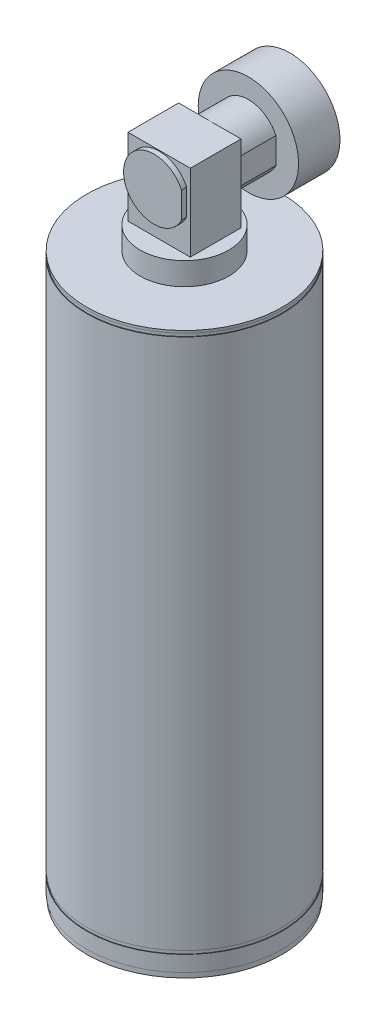
ISO-10303-21;
HEADER;
FILE_DESCRIPTION(('STEP AP214'),'2;1');
FILE_NAME('part.step','',(''),(''),'','','');
FILE_SCHEMA(('AUTOMOTIVE_DESIGN { 1 0 10303 214 1 1 1 1 }'));
ENDSEC;
DATA;
#1=APPLICATION_CONTEXT('core data for automotive mechanical design processes');
#2=APPLICATION_PROTOCOL_DEFINITION('international standard','automotive_design',2000,#1);
#3=PRODUCT_CONTEXT('',#1,'mechanical');
#4=PRODUCT('Part','Part','',(#3));
#5=PRODUCT_RELATED_PRODUCT_CATEGORY('part','',(#4));
#6=PRODUCT_DEFINITION_FORMATION('','',#4);
#7=PRODUCT_DEFINITION_CONTEXT('part definition',#1,'design');
#8=PRODUCT_DEFINITION('design','',#6,#7);
#9=PRODUCT_DEFINITION_SHAPE('','',#8);
#10=(LENGTH_UNIT() NAMED_UNIT(*) SI_UNIT(.MILLI.,.METRE.));
#11=(NAMED_UNIT(*) PLANE_ANGLE_UNIT() SI_UNIT($,.RADIAN.));
#12=(NAMED_UNIT(*) SI_UNIT($,.STERADIAN.) SOLID_ANGLE_UNIT());
#13=UNCERTAINTY_MEASURE_WITH_UNIT(LENGTH_MEASURE(1.E-05),#10,'distance_accuracy_value','');
#14=(GEOMETRIC_REPRESENTATION_CONTEXT(3) GLOBAL_UNCERTAINTY_ASSIGNED_CONTEXT((#13)) GLOBAL_UNIT_ASSIGNED_CONTEXT((#10,
#11,#12)) REPRESENTATION_CONTEXT('',''));
#15=CARTESIAN_POINT('',(0.,0.,0.));
#16=DIRECTION('',(0.,0.,1.));
#17=DIRECTION('',(1.,0.,0.));
#18=AXIS2_PLACEMENT_3D('',#15,#16,#17);
#19=CARTESIAN_POINT('',(-43.0000000000064,912.000000000001,35.0000000484059));
#20=DIRECTION('',(0.,0.,-1.));
#21=DIRECTION('',(-1.,0.,0.));
#22=AXIS2_PLACEMENT_3D('',#19,#20,#21);
#23=PLANE('',#22);
#24=DIRECTION('',(1.,0.,0.));
#25=VECTOR('',#24,1.);
#26=CARTESIAN_POINT('',(-43.0000000000064,805.70816,35.0000000484059));
#27=LINE('',#26,#25);
#28=CARTESIAN_POINT('',(-43.0000000000064,805.70816,35.0000000484059));
#29=VERTEX_POINT('',#28);
#30=CARTESIAN_POINT('',(42.9999999999779,805.70816,35.0000000484059));
#31=VERTEX_POINT('',#30);
#32=EDGE_CURVE('E142',#29,#31,#27,.T.);
#33=ORIENTED_EDGE('',*,*,#32,.T.);
#34=DIRECTION('',(0.,-1.,0.));
#35=VECTOR('',#34,1.);
#36=CARTESIAN_POINT('',(42.9999999999779,912.000000000001,35.0000000484059));
#37=LINE('',#36,#35);
#38=CARTESIAN_POINT('',(42.9999999999779,912.000000000001,35.0000000484059));
#39=VERTEX_POINT('',#38);
#40=EDGE_CURVE('E152',#39,#31,#37,.T.);
#41=ORIENTED_EDGE('',*,*,#40,.F.);
#42=DIRECTION('',(1.,0.,0.));
#43=VECTOR('',#42,1.);
#44=CARTESIAN_POINT('',(-43.0000000000064,912.000000000001,35.0000000484059));
#45=LINE('',#44,#43);
#46=CARTESIAN_POINT('',(-43.0000000000064,912.000000000001,35.0000000484059));
#47=VERTEX_POINT('',#46);
#48=EDGE_CURVE('E132',#47,#39,#45,.T.);
#49=ORIENTED_EDGE('',*,*,#48,.F.);
#50=DIRECTION('',(0.,-1.,0.));
#51=VECTOR('',#50,1.);
#52=CARTESIAN_POINT('',(-43.0000000000064,912.000000000001,35.0000000484059));
#53=LINE('',#52,#51);
#54=EDGE_CURVE('E155',#47,#29,#53,.T.);
#55=ORIENTED_EDGE('',*,*,#54,.T.);
#56=EDGE_LOOP('',(#33,#41,#49,#55));
#57=FACE_BOUND('',#56,.T.);
#58=CARTESIAN_POINT('',(0.,869.000000000002,35.0000000484059));
#59=DIRECTION('',(0.,0.,-1.));
#60=DIRECTION('',(-1.,0.,0.));
#61=AXIS2_PLACEMENT_3D('',#58,#59,#60);
#62=CIRCLE('',#61,41.999998400008);
#63=CARTESIAN_POINT('',(37.9999964871783,886.888547525587,35.0000000484059));
#64=VERTEX_POINT('',#63);
#65=CARTESIAN_POINT('',(37.9999964871783,851.111452474417,35.0000000484059));
#66=VERTEX_POINT('',#65);
#67=EDGE_CURVE('E126',#64,#66,#62,.F.);
#68=ORIENTED_EDGE('',*,*,#67,.F.);
#69=DIRECTION('',(0.,1.,0.));
#70=VECTOR('',#69,1.);
#71=CARTESIAN_POINT('',(37.9999964871783,912.000000000001,35.0000000484059));
#72=LINE('',#71,#70);
#73=EDGE_CURVE('E47',#66,#64,#72,.T.);
#74=ORIENTED_EDGE('',*,*,#73,.F.);
#75=EDGE_LOOP('',(#68,#74));
#76=FACE_BOUND('',#75,.T.);
#77=ADVANCED_FACE('F33',(#57,#76),#23,.F.);
#78=CARTESIAN_POINT('',(-43.0000000000064,912.000000000001,-34.9999999515944));
#79=DIRECTION('',(0.,0.,1.));
#80=DIRECTION('',(1.,0.,0.));
#81=AXIS2_PLACEMENT_3D('',#78,#79,#80);
#82=PLANE('',#81);
#83=DIRECTION('',(-1.,0.,0.));
#84=VECTOR('',#83,1.);
#85=CARTESIAN_POINT('',(-43.0000000000064,805.70816,-34.9999999515944));
#86=LINE('',#85,#84);
#87=CARTESIAN_POINT('',(42.9999999999779,805.70816,-34.9999999515944));
#88=VERTEX_POINT('',#87);
#89=CARTESIAN_POINT('',(-43.0000000000064,805.70816,-34.9999999515944));
#90=VERTEX_POINT('',#89);
#91=EDGE_CURVE('E133',#88,#90,#86,.T.);
#92=ORIENTED_EDGE('',*,*,#91,.T.);
#93=DIRECTION('',(0.,-1.,0.));
#94=VECTOR('',#93,1.);
#95=CARTESIAN_POINT('',(-43.0000000000064,912.000000000001,-34.9999999515944));
#96=LINE('',#95,#94);
#97=CARTESIAN_POINT('',(-43.0000000000064,912.000000000001,-34.9999999515944));
#98=VERTEX_POINT('',#97);
#99=EDGE_CURVE('E139',#98,#90,#96,.T.);
#100=ORIENTED_EDGE('',*,*,#99,.F.);
#101=DIRECTION('',(-1.,0.,0.));
#102=VECTOR('',#101,1.);
#103=CARTESIAN_POINT('',(-43.0000000000064,912.000000000001,-34.9999999515944));
#104=LINE('',#103,#102);
#105=CARTESIAN_POINT('',(42.9999999999779,912.000000000001,-34.9999999515944));
#106=VERTEX_POINT('',#105);
#107=EDGE_CURVE('E137',#106,#98,#104,.T.);
#108=ORIENTED_EDGE('',*,*,#107,.F.);
#109=DIRECTION('',(0.,-1.,0.));
#110=VECTOR('',#109,1.);
#111=CARTESIAN_POINT('',(42.9999999999779,912.000000000001,-34.9999999515944));
#112=LINE('',#111,#110);
#113=EDGE_CURVE('E150',#106,#88,#112,.T.);
#114=ORIENTED_EDGE('',*,*,#113,.T.);
#115=EDGE_LOOP('',(#92,#100,#108,#114));
#116=FACE_BOUND('',#115,.T.);
#117=CARTESIAN_POINT('',(0.,869.000000000002,-34.9999999515944));
#118=DIRECTION('',(0.,0.,1.));
#119=DIRECTION('',(1.,0.,0.));
#120=AXIS2_PLACEMENT_3D('',#117,#118,#119);
#121=CIRCLE('',#120,41.999998400008);
#122=CARTESIAN_POINT('',(37.9999964871783,851.111452474417,-34.9999999515944));
#123=VERTEX_POINT('',#122);
#124=CARTESIAN_POINT('',(37.9999964871783,886.888547525587,-34.9999999515944));
#125=VERTEX_POINT('',#124);
#126=EDGE_CURVE('E11',#123,#125,#121,.F.);
#127=ORIENTED_EDGE('',*,*,#126,.F.);
#128=DIRECTION('',(0.,-1.,0.));
#129=VECTOR('',#128,1.);
#130=CARTESIAN_POINT('',(37.9999964871783,912.000000000001,-34.9999999515944));
#131=LINE('',#130,#129);
#132=EDGE_CURVE('E41',#125,#123,#131,.T.);
#133=ORIENTED_EDGE('',*,*,#132,.F.);
#134=EDGE_LOOP('',(#127,#133));
#135=FACE_BOUND('',#134,.T.);
#136=ADVANCED_FACE('F217',(#116,#135),#82,.F.);
#137=CARTESIAN_POINT('',(0.,805.70816,0.));
#138=DIRECTION('',(0.,1.,0.));
#139=DIRECTION('',(0.,0.,1.));
#140=AXIS2_PLACEMENT_3D('',#137,#138,#139);
#141=PLANE('',#140);
#142=CARTESIAN_POINT('',(0.,805.70816,0.));
#143=DIRECTION('',(0.,1.,0.));
#144=DIRECTION('',(0.,0.,1.));
#145=AXIS2_PLACEMENT_3D('',#142,#143,#144);
#146=CIRCLE('',#145,61.1435466232673);
#147=CARTESIAN_POINT('',(0.,805.70816,61.1435466232673));
#148=VERTEX_POINT('',#147);
#149=EDGE_CURVE('E158',#148,#148,#146,.T.);
#150=ORIENTED_EDGE('',*,*,#149,.T.);
#151=EDGE_LOOP('',(#150));
#152=FACE_BOUND('',#151,.T.);
#153=ORIENTED_EDGE('',*,*,#32,.F.);
#154=DIRECTION('',(0.,0.,1.));
#155=VECTOR('',#154,1.);
#156=CARTESIAN_POINT('',(-43.0000000000064,805.70816,-34.9999999515944));
#157=LINE('',#156,#155);
#158=EDGE_CURVE('E128',#90,#29,#157,.T.);
#159=ORIENTED_EDGE('',*,*,#158,.F.);
#160=ORIENTED_EDGE('',*,*,#91,.F.);
#161=DIRECTION('',(0.,0.,-1.));
#162=VECTOR('',#161,1.);
#163=CARTESIAN_POINT('',(42.9999999999779,805.70816,-34.9999999515944));
#164=LINE('',#163,#162);
#165=EDGE_CURVE('E144',#31,#88,#164,.T.);
#166=ORIENTED_EDGE('',*,*,#165,.F.);
#167=EDGE_LOOP('',(#153,#159,#160,#166));
#168=FACE_BOUND('',#167,.T.);
#169=ADVANCED_FACE('F223',(#152,#168),#141,.T.);
#170=CARTESIAN_POINT('',(0.,774.49918,0.));
#171=DIRECTION('',(0.,1.,0.));
#172=DIRECTION('',(0.,0.,1.));
#173=AXIS2_PLACEMENT_3D('',#170,#171,#172);
#174=PLANE('',#173);
#175=CARTESIAN_POINT('',(0.,774.49918,0.));
#176=DIRECTION('',(0.,1.,0.));
#177=DIRECTION('',(0.,0.,1.));
#178=AXIS2_PLACEMENT_3D('',#175,#176,#177);
#179=CIRCLE('',#178,135.080809957641);
#180=CARTESIAN_POINT('',(0.,774.49918,135.080809957641));
#181=VERTEX_POINT('',#180);
#182=EDGE_CURVE('E164',#181,#181,#179,.T.);
#183=ORIENTED_EDGE('',*,*,#182,.T.);
#184=EDGE_LOOP('',(#183));
#185=FACE_BOUND('',#184,.T.);
#186=CARTESIAN_POINT('',(0.,774.49918,0.));
#187=DIRECTION('',(0.,1.,0.));
#188=DIRECTION('',(0.,0.,1.));
#189=AXIS2_PLACEMENT_3D('',#186,#187,#188);
#190=CIRCLE('',#189,61.1435466232673);
#191=CARTESIAN_POINT('',(0.,774.49918,61.1435466232673));
#192=VERTEX_POINT('',#191);
#193=EDGE_CURVE('E157',#192,#192,#190,.T.);
#194=ORIENTED_EDGE('',*,*,#193,.F.);
#195=EDGE_LOOP('',(#194));
#196=FACE_BOUND('',#195,.T.);
#197=ADVANCED_FACE('F236',(#185,#196),#174,.T.);
#198=CARTESIAN_POINT('',(0.,766.7852,0.));
#199=DIRECTION('',(0.,1.,0.));
#200=DIRECTION('',(0.,0.,1.));
#201=AXIS2_PLACEMENT_3D('',#198,#199,#200);
#202=PLANE('',#201);
#203=CARTESIAN_POINT('',(0.,766.7852,0.));
#204=DIRECTION('',(0.,1.,0.));
#205=DIRECTION('',(0.,0.,1.));
#206=AXIS2_PLACEMENT_3D('',#203,#204,#205);
#207=CIRCLE('',#206,135.080809957641);
#208=CARTESIAN_POINT('',(0.,766.7852,135.080809957641));
#209=VERTEX_POINT('',#208);
#210=EDGE_CURVE('E176',#209,#209,#207,.T.);
#211=ORIENTED_EDGE('',*,*,#210,.T.);
#212=EDGE_LOOP('',(#211));
#213=FACE_BOUND('',#212,.T.);
#214=CARTESIAN_POINT('',(0.,766.7852,0.));
#215=DIRECTION('',(0.,1.,0.));
#216=DIRECTION('',(0.,0.,1.));
#217=AXIS2_PLACEMENT_3D('',#214,#215,#216);
#218=CIRCLE('',#217,134.318809957641);
#219=CARTESIAN_POINT('',(0.,766.7852,134.318809957641));
#220=VERTEX_POINT('',#219);
#221=EDGE_CURVE('E167',#220,#220,#218,.T.);
#222=ORIENTED_EDGE('',*,*,#221,.F.);
#223=EDGE_LOOP('',(#222));
#224=FACE_BOUND('',#223,.T.);
#225=ADVANCED_FACE('F244',(#213,#224),#202,.T.);
#226=CARTESIAN_POINT('',(0.,28.6905999999991,0.));
#227=DIRECTION('',(0.,1.,0.));
#228=DIRECTION('',(0.,0.,1.));
#229=AXIS2_PLACEMENT_3D('',#226,#227,#228);
#230=PLANE('',#229);
#231=CARTESIAN_POINT('',(0.,28.6905999999991,0.));
#232=DIRECTION('',(0.,1.,0.));
#233=DIRECTION('',(0.,0.,1.));
#234=AXIS2_PLACEMENT_3D('',#231,#232,#233);
#235=CIRCLE('',#234,135.080809957641);
#236=CARTESIAN_POINT('',(0.,28.6905999999991,135.080809957641));
#237=VERTEX_POINT('',#236);
#238=EDGE_CURVE('E188',#237,#237,#235,.T.);
#239=ORIENTED_EDGE('',*,*,#238,.T.);
#240=EDGE_LOOP('',(#239));
#241=FACE_BOUND('',#240,.T.);
#242=CARTESIAN_POINT('',(0.,28.6905999999991,0.));
#243=DIRECTION('',(0.,1.,0.));
#244=DIRECTION('',(0.,0.,1.));
#245=AXIS2_PLACEMENT_3D('',#242,#243,#244);
#246=CIRCLE('',#245,134.318809957641);
#247=CARTESIAN_POINT('',(0.,28.6905999999991,134.318809957641));
#248=VERTEX_POINT('',#247);
#249=EDGE_CURVE('E179',#248,#248,#246,.T.);
#250=ORIENTED_EDGE('',*,*,#249,.F.);
#251=EDGE_LOOP('',(#250));
#252=FACE_BOUND('',#251,.T.);
#253=ADVANCED_FACE('F212',(#241,#252),#230,.T.);
#254=CARTESIAN_POINT('',(0.,7.0358,0.));
#255=DIRECTION('',(0.,-1.,0.));
#256=DIRECTION('',(0.,0.,-1.));
#257=AXIS2_PLACEMENT_3D('',#254,#255,#256);
#258=CYLINDRICAL_SURFACE('',#257,134.318809957641);
#259=CARTESIAN_POINT('',(0.,7.0358,0.));
#260=DIRECTION('',(0.,1.,0.));
#261=DIRECTION('',(0.,0.,1.));
#262=AXIS2_PLACEMENT_3D('',#259,#260,#261);
#263=CIRCLE('',#262,134.318809957641);
#264=CARTESIAN_POINT('',(0.,7.0358,134.318809957641));
#265=VERTEX_POINT('',#264);
#266=EDGE_CURVE('E194',#265,#265,#263,.T.);
#267=ORIENTED_EDGE('',*,*,#266,.F.);
#268=EDGE_LOOP('',(#267));
#269=FACE_BOUND('',#268,.T.);
#270=CARTESIAN_POINT('',(0.,0.,0.));
#271=DIRECTION('',(0.,1.,0.));
#272=DIRECTION('',(0.,0.,1.));
#273=AXIS2_PLACEMENT_3D('',#270,#271,#272);
#274=CIRCLE('',#273,134.318809957641);
#275=CARTESIAN_POINT('',(0.,0.,134.318809957641));
#276=VERTEX_POINT('',#275);
#277=EDGE_CURVE('E191',#276,#276,#274,.T.);
#278=ORIENTED_EDGE('',*,*,#277,.T.);
#279=EDGE_LOOP('',(#278));
#280=FACE_BOUND('',#279,.T.);
#281=ADVANCED_FACE('F35',(#269,#280),#258,.T.);
#282=CARTESIAN_POINT('',(0.,0.,0.));
#283=DIRECTION('',(0.,1.,0.));
#284=DIRECTION('',(0.,0.,1.));
#285=AXIS2_PLACEMENT_3D('',#282,#283,#284);
#286=PLANE('',#285);
#287=CARTESIAN_POINT('',(0.,0.,0.));
#288=DIRECTION('',(0.,-1.,0.));
#289=DIRECTION('',(0.,0.,-1.));
#290=AXIS2_PLACEMENT_3D('',#287,#288,#289);
#291=CIRCLE('',#290,31.1916417026283);
#292=CARTESIAN_POINT('',(0.,0.,-31.1916417026283));
#293=VERTEX_POINT('',#292);
#294=EDGE_CURVE('E503',#293,#293,#291,.T.);
#295=ORIENTED_EDGE('',*,*,#294,.F.);
#296=EDGE_LOOP('',(#295));
#297=FACE_BOUND('',#296,.T.);
#298=ORIENTED_EDGE('',*,*,#277,.F.);
#299=EDGE_LOOP('',(#298));
#300=FACE_BOUND('',#299,.T.);
#301=ADVANCED_FACE('F201',(#297,#300),#286,.F.);
#302=CARTESIAN_POINT('',(0.,7.0358,0.));
#303=DIRECTION('',(0.,1.,0.));
#304=DIRECTION('',(0.,0.,1.));
#305=AXIS2_PLACEMENT_3D('',#302,#303,#304);
#306=PLANE('',#305);
#307=CARTESIAN_POINT('',(0.,7.0358,0.));
#308=DIRECTION('',(0.,1.,0.));
#309=DIRECTION('',(0.,0.,1.));
#310=AXIS2_PLACEMENT_3D('',#307,#308,#309);
#311=CIRCLE('',#310,135.080809957641);
#312=CARTESIAN_POINT('',(0.,7.0358,135.080809957641));
#313=VERTEX_POINT('',#312);
#314=EDGE_CURVE('E185',#313,#313,#311,.T.);
#315=ORIENTED_EDGE('',*,*,#314,.F.);
#316=EDGE_LOOP('',(#315));
#317=FACE_BOUND('',#316,.T.);
#318=ORIENTED_EDGE('',*,*,#266,.T.);
#319=EDGE_LOOP('',(#318));
#320=FACE_BOUND('',#319,.T.);
#321=ADVANCED_FACE('F203',(#317,#320),#306,.F.);
#322=CARTESIAN_POINT('',(0.,28.6905999999991,0.));
#323=DIRECTION('',(0.,-1.,0.));
#324=DIRECTION('',(0.,0.,-1.));
#325=AXIS2_PLACEMENT_3D('',#322,#323,#324);
#326=CYLINDRICAL_SURFACE('',#325,135.080809957641);
#327=ORIENTED_EDGE('',*,*,#238,.F.);
#328=EDGE_LOOP('',(#327));
#329=FACE_BOUND('',#328,.T.);
#330=ORIENTED_EDGE('',*,*,#314,.T.);
#331=EDGE_LOOP('',(#330));
#332=FACE_BOUND('',#331,.T.);
#333=ADVANCED_FACE('F209',(#329,#332),#326,.T.);
#334=CARTESIAN_POINT('',(0.,33.3094000000003,0.));
#335=DIRECTION('',(0.,-1.,0.));
#336=DIRECTION('',(0.,0.,-1.));
#337=AXIS2_PLACEMENT_3D('',#334,#335,#336);
#338=CYLINDRICAL_SURFACE('',#337,134.318809957641);
#339=CARTESIAN_POINT('',(0.,33.3094000000003,0.));
#340=DIRECTION('',(0.,1.,0.));
#341=DIRECTION('',(0.,0.,1.));
#342=AXIS2_PLACEMENT_3D('',#339,#340,#341);
#343=CIRCLE('',#342,134.318809957641);
#344=CARTESIAN_POINT('',(0.,33.3094000000003,134.318809957641));
#345=VERTEX_POINT('',#344);
#346=EDGE_CURVE('E182',#345,#345,#343,.T.);
#347=ORIENTED_EDGE('',*,*,#346,.F.);
#348=EDGE_LOOP('',(#347));
#349=FACE_BOUND('',#348,.T.);
#350=ORIENTED_EDGE('',*,*,#249,.T.);
#351=EDGE_LOOP('',(#350));
#352=FACE_BOUND('',#351,.T.);
#353=ADVANCED_FACE('F264',(#349,#352),#338,.T.);
#354=CARTESIAN_POINT('',(0.,33.3094000000003,0.));
#355=DIRECTION('',(0.,1.,0.));
#356=DIRECTION('',(0.,0.,1.));
#357=AXIS2_PLACEMENT_3D('',#354,#355,#356);
#358=PLANE('',#357);
#359=CARTESIAN_POINT('',(0.,33.3094000000003,0.));
#360=DIRECTION('',(0.,1.,0.));
#361=DIRECTION('',(0.,0.,1.));
#362=AXIS2_PLACEMENT_3D('',#359,#360,#361);
#363=CIRCLE('',#362,135.080809957641);
#364=CARTESIAN_POINT('',(0.,33.3094000000003,135.080809957641));
#365=VERTEX_POINT('',#364);
#366=EDGE_CURVE('E173',#365,#365,#363,.T.);
#367=ORIENTED_EDGE('',*,*,#366,.F.);
#368=EDGE_LOOP('',(#367));
#369=FACE_BOUND('',#368,.T.);
#370=ORIENTED_EDGE('',*,*,#346,.T.);
#371=EDGE_LOOP('',(#370));
#372=FACE_BOUND('',#371,.T.);
#373=ADVANCED_FACE('F261',(#369,#372),#358,.F.);
#374=CARTESIAN_POINT('',(0.,766.7852,0.));
#375=DIRECTION('',(0.,-1.,0.));
#376=DIRECTION('',(0.,0.,-1.));
#377=AXIS2_PLACEMENT_3D('',#374,#375,#376);
#378=CYLINDRICAL_SURFACE('',#377,135.080809957641);
#379=ORIENTED_EDGE('',*,*,#210,.F.);
#380=EDGE_LOOP('',(#379));
#381=FACE_BOUND('',#380,.T.);
#382=ORIENTED_EDGE('',*,*,#366,.T.);
#383=EDGE_LOOP('',(#382));
#384=FACE_BOUND('',#383,.T.);
#385=ADVANCED_FACE('F256',(#381,#384),#378,.T.);
#386=CARTESIAN_POINT('',(0.,771.2302,0.));
#387=DIRECTION('',(0.,-1.,0.));
#388=DIRECTION('',(0.,0.,-1.));
#389=AXIS2_PLACEMENT_3D('',#386,#387,#388);
#390=CYLINDRICAL_SURFACE('',#389,134.318809957641);
#391=CARTESIAN_POINT('',(0.,771.2302,0.));
#392=DIRECTION('',(0.,1.,0.));
#393=DIRECTION('',(0.,0.,1.));
#394=AXIS2_PLACEMENT_3D('',#391,#392,#393);
#395=CIRCLE('',#394,134.318809957641);
#396=CARTESIAN_POINT('',(0.,771.2302,134.318809957641));
#397=VERTEX_POINT('',#396);
#398=EDGE_CURVE('E170',#397,#397,#395,.T.);
#399=ORIENTED_EDGE('',*,*,#398,.F.);
#400=EDGE_LOOP('',(#399));
#401=FACE_BOUND('',#400,.T.);
#402=ORIENTED_EDGE('',*,*,#221,.T.);
#403=EDGE_LOOP('',(#402));
#404=FACE_BOUND('',#403,.T.);
#405=ADVANCED_FACE('F249',(#401,#404),#390,.T.);
#406=CARTESIAN_POINT('',(0.,771.2302,0.));
#407=DIRECTION('',(0.,1.,0.));
#408=DIRECTION('',(0.,0.,1.));
#409=AXIS2_PLACEMENT_3D('',#406,#407,#408);
#410=PLANE('',#409);
#411=CARTESIAN_POINT('',(0.,771.2302,0.));
#412=DIRECTION('',(0.,1.,0.));
#413=DIRECTION('',(0.,0.,1.));
#414=AXIS2_PLACEMENT_3D('',#411,#412,#413);
#415=CIRCLE('',#414,135.080809957641);
#416=CARTESIAN_POINT('',(0.,771.2302,135.080809957641));
#417=VERTEX_POINT('',#416);
#418=EDGE_CURVE('E161',#417,#417,#415,.T.);
#419=ORIENTED_EDGE('',*,*,#418,.F.);
#420=EDGE_LOOP('',(#419));
#421=FACE_BOUND('',#420,.T.);
#422=ORIENTED_EDGE('',*,*,#398,.T.);
#423=EDGE_LOOP('',(#422));
#424=FACE_BOUND('',#423,.T.);
#425=ADVANCED_FACE('F246',(#421,#424),#410,.F.);
#426=CARTESIAN_POINT('',(0.,774.49918,0.));
#427=DIRECTION('',(0.,-1.,0.));
#428=DIRECTION('',(0.,0.,-1.));
#429=AXIS2_PLACEMENT_3D('',#426,#427,#428);
#430=CYLINDRICAL_SURFACE('',#429,135.080809957641);
#431=ORIENTED_EDGE('',*,*,#182,.F.);
#432=EDGE_LOOP('',(#431));
#433=FACE_BOUND('',#432,.T.);
#434=ORIENTED_EDGE('',*,*,#418,.T.);
#435=EDGE_LOOP('',(#434));
#436=FACE_BOUND('',#435,.T.);
#437=ADVANCED_FACE('F240',(#433,#436),#430,.T.);
#438=CARTESIAN_POINT('',(0.,805.70816,0.));
#439=DIRECTION('',(0.,-1.,0.));
#440=DIRECTION('',(0.,0.,-1.));
#441=AXIS2_PLACEMENT_3D('',#438,#439,#440);
#442=CYLINDRICAL_SURFACE('',#441,61.1435466232673);
#443=ORIENTED_EDGE('',*,*,#149,.F.);
#444=EDGE_LOOP('',(#443));
#445=FACE_BOUND('',#444,.T.);
#446=ORIENTED_EDGE('',*,*,#193,.T.);
#447=EDGE_LOOP('',(#446));
#448=FACE_BOUND('',#447,.T.);
#449=ADVANCED_FACE('F232',(#445,#448),#442,.T.);
#450=CARTESIAN_POINT('',(-43.0000000000064,912.000000000001,-34.9999999515944));
#451=DIRECTION('',(1.,0.,0.));
#452=DIRECTION('',(0.,0.,-1.));
#453=AXIS2_PLACEMENT_3D('',#450,#451,#452);
#454=PLANE('',#453);
#455=ORIENTED_EDGE('',*,*,#158,.T.);
#456=ORIENTED_EDGE('',*,*,#54,.F.);
#457=DIRECTION('',(0.,0.,1.));
#458=VECTOR('',#457,1.);
#459=CARTESIAN_POINT('',(-43.0000000000064,912.000000000001,-34.9999999515944));
#460=LINE('',#459,#458);
#461=EDGE_CURVE('E129',#98,#47,#460,.T.);
#462=ORIENTED_EDGE('',*,*,#461,.F.);
#463=ORIENTED_EDGE('',*,*,#99,.T.);
#464=EDGE_LOOP('',(#455,#456,#462,#463));
#465=FACE_BOUND('',#464,.T.);
#466=ADVANCED_FACE('F229',(#465),#454,.F.);
#467=CARTESIAN_POINT('',(42.9999999999779,912.000000000001,-34.9999999515944));
#468=DIRECTION('',(-1.,0.,0.));
#469=DIRECTION('',(0.,0.,1.));
#470=AXIS2_PLACEMENT_3D('',#467,#468,#469);
#471=PLANE('',#470);
#472=ORIENTED_EDGE('',*,*,#165,.T.);
#473=ORIENTED_EDGE('',*,*,#113,.F.);
#474=DIRECTION('',(0.,0.,-1.));
#475=VECTOR('',#474,1.);
#476=CARTESIAN_POINT('',(42.9999999999779,912.000000000001,-34.9999999515944));
#477=LINE('',#476,#475);
#478=EDGE_CURVE('E135',#39,#106,#477,.T.);
#479=ORIENTED_EDGE('',*,*,#478,.F.);
#480=ORIENTED_EDGE('',*,*,#40,.T.);
#481=EDGE_LOOP('',(#472,#473,#479,#480));
#482=FACE_BOUND('',#481,.T.);
#483=ADVANCED_FACE('F228',(#482),#471,.F.);
#484=CARTESIAN_POINT('',(-43.0000000000064,912.000000000001,35.0000000484059));
#485=DIRECTION('',(0.,1.,0.));
#486=DIRECTION('',(0.,0.,1.));
#487=AXIS2_PLACEMENT_3D('',#484,#485,#486);
#488=PLANE('',#487);
#489=ORIENTED_EDGE('',*,*,#461,.T.);
#490=ORIENTED_EDGE('',*,*,#48,.T.);
#491=ORIENTED_EDGE('',*,*,#478,.T.);
#492=ORIENTED_EDGE('',*,*,#107,.T.);
#493=EDGE_LOOP('',(#489,#490,#491,#492));
#494=FACE_BOUND('',#493,.T.);
#495=ADVANCED_FACE('F330',(#494),#488,.T.);
#496=CARTESIAN_POINT('',(37.9999964871783,886.888547525587,42.0789800484059));
#497=DIRECTION('',(-1.,0.,0.));
#498=DIRECTION('',(0.,0.,1.));
#499=AXIS2_PLACEMENT_3D('',#496,#497,#498);
#500=PLANE('',#499);
#501=DIRECTION('',(0.,0.,-1.));
#502=VECTOR('',#501,1.);
#503=CARTESIAN_POINT('',(37.9999964871783,886.888547525587,42.0789800484059));
#504=LINE('',#503,#502);
#505=CARTESIAN_POINT('',(37.9999964871783,886.888547525587,-88.1899999515941));
#506=VERTEX_POINT('',#505);
#507=EDGE_CURVE('E106',#125,#506,#504,.T.);
#508=ORIENTED_EDGE('',*,*,#507,.F.);
#509=ORIENTED_EDGE('',*,*,#132,.T.);
#510=DIRECTION('',(0.,0.,-1.));
#511=VECTOR('',#510,1.);
#512=CARTESIAN_POINT('',(37.9999964871783,851.111452474417,42.0789800484059));
#513=LINE('',#512,#511);
#514=CARTESIAN_POINT('',(37.9999964871783,851.111452474417,-88.1899999515941));
#515=VERTEX_POINT('',#514);
#516=EDGE_CURVE('E113',#123,#515,#513,.T.);
#517=ORIENTED_EDGE('',*,*,#516,.T.);
#518=DIRECTION('',(0.,1.,0.));
#519=VECTOR('',#518,1.);
#520=CARTESIAN_POINT('',(37.9999964871783,886.888547525587,-88.1899999515941));
#521=LINE('',#520,#519);
#522=EDGE_CURVE('E99',#515,#506,#521,.T.);
#523=ORIENTED_EDGE('',*,*,#522,.T.);
#524=EDGE_LOOP('',(#508,#509,#517,#523));
#525=FACE_BOUND('',#524,.T.);
#526=ADVANCED_FACE('F112',(#525),#500,.F.);
#527=CARTESIAN_POINT('',(0.,869.000000000002,42.0789800484059));
#528=DIRECTION('',(0.,0.,-1.));
#529=DIRECTION('',(-1.,0.,0.));
#530=AXIS2_PLACEMENT_3D('',#527,#528,#529);
#531=CYLINDRICAL_SURFACE('',#530,41.999998400008);
#532=ORIENTED_EDGE('',*,*,#516,.F.);
#533=ORIENTED_EDGE('',*,*,#126,.T.);
#534=ORIENTED_EDGE('',*,*,#507,.T.);
#535=CARTESIAN_POINT('',(0.,869.000000000002,-88.1899999515941));
#536=DIRECTION('',(0.,0.,1.));
#537=DIRECTION('',(1.,0.,0.));
#538=AXIS2_PLACEMENT_3D('',#535,#536,#537);
#539=CIRCLE('',#538,41.999998400008);
#540=EDGE_CURVE('E95',#506,#515,#539,.T.);
#541=ORIENTED_EDGE('',*,*,#540,.T.);
#542=EDGE_LOOP('',(#532,#533,#534,#541));
#543=FACE_BOUND('',#542,.T.);
#544=ADVANCED_FACE('F107',(#543),#531,.T.);
#545=CARTESIAN_POINT('',(37.9999964871783,886.888547525587,42.0789800484059));
#546=VERTEX_POINT('',#545);
#547=EDGE_CURVE('E109',#546,#64,#504,.T.);
#548=ORIENTED_EDGE('',*,*,#547,.T.);
#549=ORIENTED_EDGE('',*,*,#67,.T.);
#550=CARTESIAN_POINT('',(37.9999964871783,851.111452474417,42.0789800484059));
#551=VERTEX_POINT('',#550);
#552=EDGE_CURVE('E122',#551,#66,#513,.T.);
#553=ORIENTED_EDGE('',*,*,#552,.F.);
#554=CARTESIAN_POINT('',(0.,869.000000000002,42.0789800484059));
#555=DIRECTION('',(0.,0.,1.));
#556=DIRECTION('',(1.,0.,0.));
#557=AXIS2_PLACEMENT_3D('',#554,#555,#556);
#558=CIRCLE('',#557,41.999998400008);
#559=EDGE_CURVE('E114',#546,#551,#558,.T.);
#560=ORIENTED_EDGE('',*,*,#559,.F.);
#561=EDGE_LOOP('',(#548,#549,#553,#560));
#562=FACE_BOUND('',#561,.T.);
#563=ADVANCED_FACE('F352',(#562),#531,.T.);
#564=ORIENTED_EDGE('',*,*,#552,.T.);
#565=ORIENTED_EDGE('',*,*,#73,.T.);
#566=ORIENTED_EDGE('',*,*,#547,.F.);
#567=DIRECTION('',(0.,1.,0.));
#568=VECTOR('',#567,1.);
#569=CARTESIAN_POINT('',(37.9999964871783,886.888547525587,42.0789800484059));
#570=LINE('',#569,#568);
#571=EDGE_CURVE('E110',#551,#546,#570,.T.);
#572=ORIENTED_EDGE('',*,*,#571,.F.);
#573=EDGE_LOOP('',(#564,#565,#566,#572));
#574=FACE_BOUND('',#573,.T.);
#575=ADVANCED_FACE('F345',(#574),#500,.F.);
#576=CARTESIAN_POINT('',(0.,869.000000000002,42.0789800484059));
#577=DIRECTION('',(0.,0.,1.));
#578=DIRECTION('',(1.,0.,0.));
#579=AXIS2_PLACEMENT_3D('',#576,#577,#578);
#580=PLANE('',#579);
#581=ORIENTED_EDGE('',*,*,#559,.T.);
#582=ORIENTED_EDGE('',*,*,#571,.T.);
#583=EDGE_LOOP('',(#581,#582));
#584=FACE_BOUND('',#583,.T.);
#585=ADVANCED_FACE('F367',(#584),#580,.T.);
#586=CARTESIAN_POINT('',(0.,869.000000000002,-88.1899999515941));
#587=DIRECTION('',(0.,0.,-1.));
#588=DIRECTION('',(-1.,0.,0.));
#589=AXIS2_PLACEMENT_3D('',#586,#587,#588);
#590=PLANE('',#589);
#591=CARTESIAN_POINT('',(0.,869.000000000002,-88.1899999515941));
#592=DIRECTION('',(0.,0.,-1.));
#593=DIRECTION('',(-1.,0.,0.));
#594=AXIS2_PLACEMENT_3D('',#591,#592,#593);
#595=CIRCLE('',#594,69.2405522085047);
#596=CARTESIAN_POINT('',(-69.2405522085047,869.000000000002,-88.1899999515941));
#597=VERTEX_POINT('',#596);
#598=EDGE_CURVE('E502',#597,#597,#595,.T.);
#599=ORIENTED_EDGE('',*,*,#598,.F.);
#600=EDGE_LOOP('',(#599));
#601=FACE_BOUND('',#600,.T.);
#602=ORIENTED_EDGE('',*,*,#540,.F.);
#603=ORIENTED_EDGE('',*,*,#522,.F.);
#604=EDGE_LOOP('',(#602,#603));
#605=FACE_BOUND('',#604,.T.);
#606=ADVANCED_FACE('F97',(#601,#605),#590,.F.);
#607=CARTESIAN_POINT('',(0.,869.000000000002,-145.339999951594));
#608=DIRECTION('',(0.,0.,1.));
#609=DIRECTION('',(1.,0.,0.));
#610=AXIS2_PLACEMENT_3D('',#607,#608,#609);
#611=CYLINDRICAL_SURFACE('',#610,69.2405522085047);
#612=CARTESIAN_POINT('',(0.,869.000000000002,-145.339999951594));
#613=DIRECTION('',(0.,0.,-1.));
#614=DIRECTION('',(-1.,0.,0.));
#615=AXIS2_PLACEMENT_3D('',#612,#613,#614);
#616=CIRCLE('',#615,69.2405522085047);
#617=CARTESIAN_POINT('',(-69.2405522085047,869.000000000002,-145.339999951594));
#618=VERTEX_POINT('',#617);
#619=EDGE_CURVE('E103',#618,#618,#616,.T.);
#620=ORIENTED_EDGE('',*,*,#619,.F.);
#621=EDGE_LOOP('',(#620));
#622=FACE_BOUND('',#621,.T.);
#623=ORIENTED_EDGE('',*,*,#598,.T.);
#624=EDGE_LOOP('',(#623));
#625=FACE_BOUND('',#624,.T.);
#626=ADVANCED_FACE('F379',(#622,#625),#611,.T.);
#627=CARTESIAN_POINT('',(0.,869.000000000002,-145.339999951594));
#628=DIRECTION('',(0.,0.,-1.));
#629=DIRECTION('',(-1.,0.,0.));
#630=AXIS2_PLACEMENT_3D('',#627,#628,#629);
#631=PLANE('',#630);
#632=ORIENTED_EDGE('',*,*,#619,.T.);
#633=EDGE_LOOP('',(#632));
#634=FACE_BOUND('',#633,.T.);
#635=ADVANCED_FACE('F387',(#634),#631,.T.);
#636=CARTESIAN_POINT('',(0.,758.28398,0.));
#637=DIRECTION('',(0.,-1.,0.));
#638=DIRECTION('',(0.,0.,-1.));
#639=AXIS2_PLACEMENT_3D('',#636,#637,#638);
#640=CYLINDRICAL_SURFACE('',#639,31.1916417026283);
#641=CARTESIAN_POINT('',(0.,758.28398,0.));
#642=DIRECTION('',(0.,-1.,0.));
#643=DIRECTION('',(0.,0.,-1.));
#644=AXIS2_PLACEMENT_3D('',#641,#642,#643);
#645=CIRCLE('',#644,31.1916417026283);
#646=CARTESIAN_POINT('',(0.,758.28398,-31.1916417026283));
#647=VERTEX_POINT('',#646);
#648=EDGE_CURVE('E501',#647,#647,#645,.T.);
#649=ORIENTED_EDGE('',*,*,#648,.F.);
#650=EDGE_LOOP('',(#649));
#651=FACE_BOUND('',#650,.T.);
#652=ORIENTED_EDGE('',*,*,#294,.T.);
#653=EDGE_LOOP('',(#652));
#654=FACE_BOUND('',#653,.T.);
#655=ADVANCED_FACE('F395',(#651,#654),#640,.F.);
#656=CARTESIAN_POINT('',(0.,758.28398,0.));
#657=DIRECTION('',(0.,-1.,0.));
#658=DIRECTION('',(0.,0.,-1.));
#659=AXIS2_PLACEMENT_3D('',#656,#657,#658);
#660=PLANE('',#659);
#661=ORIENTED_EDGE('',*,*,#648,.T.);
#662=EDGE_LOOP('',(#661));
#663=FACE_BOUND('',#662,.T.);
#664=ADVANCED_FACE('F403',(#663),#660,.T.);
#665=CLOSED_SHELL('',(#77,#136,#169,#197,#225,#253,#281,#301,#321,#333,#353,#373,#385,#405,#425,
#437,#449,#466,#483,#495,#526,#544,#563,#575,#585,#606,#626,#635,#655,#664));
#666=MANIFOLD_SOLID_BREP('B2',#665);
#667=ADVANCED_BREP_SHAPE_REPRESENTATION('',(#18,#666),#14);
#668=SHAPE_DEFINITION_REPRESENTATION(#9,#667);
ENDSEC;
END-ISO-10303-21;
